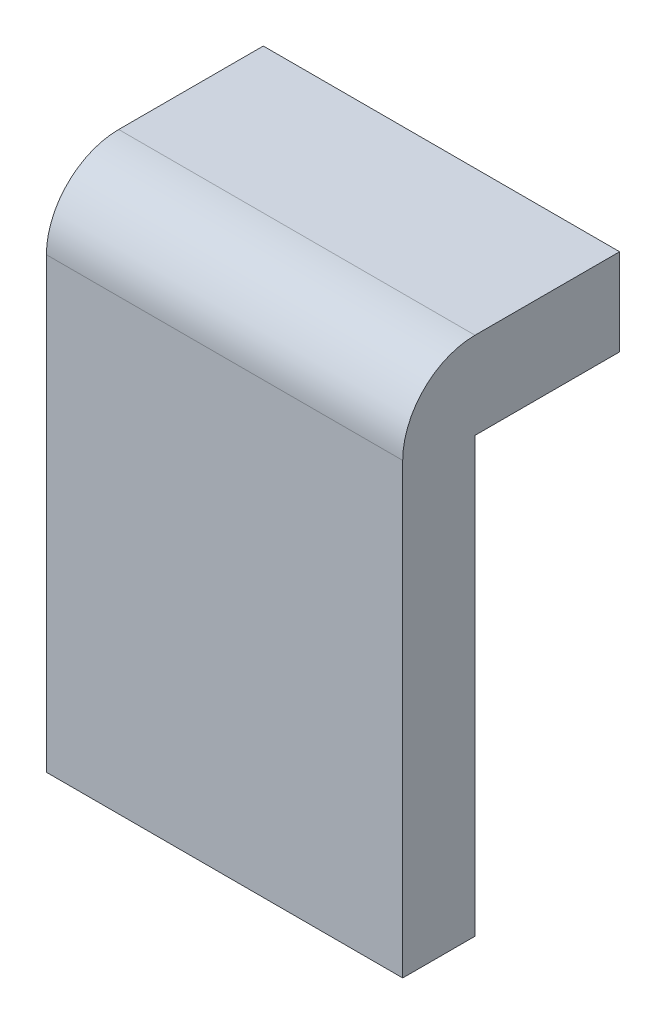
ISO-10303-21;
HEADER;
FILE_DESCRIPTION(('STEP AP214'),'2;1');
FILE_NAME('part.step','',(''),(''),'','','');
FILE_SCHEMA(('AUTOMOTIVE_DESIGN { 1 0 10303 214 1 1 1 1 }'));
ENDSEC;
DATA;
#1=APPLICATION_CONTEXT('core data for automotive mechanical design processes');
#2=APPLICATION_PROTOCOL_DEFINITION('international standard','automotive_design',2000,#1);
#3=PRODUCT_CONTEXT('',#1,'mechanical');
#4=PRODUCT('Part','Part','',(#3));
#5=PRODUCT_RELATED_PRODUCT_CATEGORY('part','',(#4));
#6=PRODUCT_DEFINITION_FORMATION('','',#4);
#7=PRODUCT_DEFINITION_CONTEXT('part definition',#1,'design');
#8=PRODUCT_DEFINITION('design','',#6,#7);
#9=PRODUCT_DEFINITION_SHAPE('','',#8);
#10=(LENGTH_UNIT() NAMED_UNIT(*) SI_UNIT(.MILLI.,.METRE.));
#11=(NAMED_UNIT(*) PLANE_ANGLE_UNIT() SI_UNIT($,.RADIAN.));
#12=(NAMED_UNIT(*) SI_UNIT($,.STERADIAN.) SOLID_ANGLE_UNIT());
#13=UNCERTAINTY_MEASURE_WITH_UNIT(LENGTH_MEASURE(1.E-05),#10,'distance_accuracy_value','');
#14=(GEOMETRIC_REPRESENTATION_CONTEXT(3) GLOBAL_UNCERTAINTY_ASSIGNED_CONTEXT((#13)) GLOBAL_UNIT_ASSIGNED_CONTEXT((#10,
#11,#12)) REPRESENTATION_CONTEXT('',''));
#15=CARTESIAN_POINT('',(0.,0.,0.));
#16=DIRECTION('',(0.,0.,1.));
#17=DIRECTION('',(1.,0.,0.));
#18=AXIS2_PLACEMENT_3D('',#15,#16,#17);
#19=CARTESIAN_POINT('',(-8.34906661620967,8.30000000000001,12.2546737770755));
#20=DIRECTION('',(0.,0.,1.));
#21=DIRECTION('',(0.,-1.,0.));
#22=AXIS2_PLACEMENT_3D('',#19,#20,#21);
#23=PLANE('',#22);
#24=DIRECTION('',(1.,0.,0.));
#25=VECTOR('',#24,1.);
#26=CARTESIAN_POINT('',(-15.8147962412963,6.80000000000003,12.2546737770755));
#27=LINE('',#26,#25);
#28=CARTESIAN_POINT('',(21.709066144855,6.80000000000003,12.2546737770755));
#29=VERTEX_POINT('',#28);
#30=CARTESIAN_POINT('',(22.9412169012958,6.80000000000003,12.2546737770755));
#31=VERTEX_POINT('',#30);
#32=EDGE_CURVE('E113',#29,#31,#27,.T.);
#33=ORIENTED_EDGE('',*,*,#32,.F.);
#34=DIRECTION('',(0.,1.,0.));
#35=VECTOR('',#34,1.);
#36=CARTESIAN_POINT('',(21.709066144855,5.35753839337147,12.2546737770755));
#37=LINE('',#36,#35);
#38=CARTESIAN_POINT('',(21.709066144855,8.30000000000001,12.2546737770755));
#39=VERTEX_POINT('',#38);
#40=EDGE_CURVE('E148',#39,#29,#37,.F.);
#41=ORIENTED_EDGE('',*,*,#40,.F.);
#42=DIRECTION('',(1.,0.,0.));
#43=VECTOR('',#42,1.);
#44=CARTESIAN_POINT('',(-8.34906661620967,8.30000000000001,12.2546737770755));
#45=LINE('',#44,#43);
#46=CARTESIAN_POINT('',(22.9412169012958,8.30000000000001,12.2546737770755));
#47=VERTEX_POINT('',#46);
#48=EDGE_CURVE('E133',#39,#47,#45,.T.);
#49=ORIENTED_EDGE('',*,*,#48,.T.);
#50=DIRECTION('',(0.,1.,0.));
#51=VECTOR('',#50,1.);
#52=CARTESIAN_POINT('',(22.9412169012958,5.35753839337147,12.2546737770755));
#53=LINE('',#52,#51);
#54=EDGE_CURVE('E105',#31,#47,#53,.T.);
#55=ORIENTED_EDGE('',*,*,#54,.F.);
#56=EDGE_LOOP('',(#33,#41,#49,#55));
#57=FACE_BOUND('',#56,.T.);
#58=ADVANCED_FACE('F17',(#57),#23,.F.);
#59=CARTESIAN_POINT('',(-8.34906661620967,8.30000000000001,11.7546737770755));
#60=DIRECTION('',(0.,1.,0.));
#61=DIRECTION('',(0.,0.,1.));
#62=AXIS2_PLACEMENT_3D('',#59,#60,#61);
#63=PLANE('',#62);
#64=ORIENTED_EDGE('',*,*,#48,.F.);
#65=DIRECTION('',(0.,0.,1.));
#66=VECTOR('',#65,1.);
#67=CARTESIAN_POINT('',(21.709066144855,8.30000000000001,12.5046737770755));
#68=LINE('',#67,#66);
#69=CARTESIAN_POINT('',(21.709066144855,8.30000000000001,11.7546737770755));
#70=VERTEX_POINT('',#69);
#71=EDGE_CURVE('E153',#70,#39,#68,.T.);
#72=ORIENTED_EDGE('',*,*,#71,.F.);
#73=DIRECTION('',(1.,0.,0.));
#74=VECTOR('',#73,1.);
#75=CARTESIAN_POINT('',(21.709066144855,8.30000000000001,11.7546737770755));
#76=LINE('',#75,#74);
#77=CARTESIAN_POINT('',(22.9412169012958,8.30000000000001,11.7546737770755));
#78=VERTEX_POINT('',#77);
#79=EDGE_CURVE('E124',#78,#70,#76,.F.);
#80=ORIENTED_EDGE('',*,*,#79,.F.);
#81=DIRECTION('',(0.,0.,-1.));
#82=VECTOR('',#81,1.);
#83=CARTESIAN_POINT('',(22.9412169012958,8.30000000000001,12.5046737770755));
#84=LINE('',#83,#82);
#85=EDGE_CURVE('E129',#47,#78,#84,.T.);
#86=ORIENTED_EDGE('',*,*,#85,.F.);
#87=EDGE_LOOP('',(#64,#72,#80,#86));
#88=FACE_BOUND('',#87,.T.);
#89=ADVANCED_FACE('F175',(#88),#63,.F.);
#90=CARTESIAN_POINT('',(21.709066144855,5.35753839337146,11.7546737770755));
#91=DIRECTION('',(0.,0.,-1.));
#92=DIRECTION('',(0.,1.,0.));
#93=AXIS2_PLACEMENT_3D('',#90,#91,#92);
#94=PLANE('',#93);
#95=ORIENTED_EDGE('',*,*,#79,.T.);
#96=DIRECTION('',(0.,1.,0.));
#97=VECTOR('',#96,1.);
#98=CARTESIAN_POINT('',(21.709066144855,5.35753839337147,11.7546737770755));
#99=LINE('',#98,#97);
#100=CARTESIAN_POINT('',(21.709066144855,8.6,11.7546737770755));
#101=VERTEX_POINT('',#100);
#102=EDGE_CURVE('E119',#101,#70,#99,.F.);
#103=ORIENTED_EDGE('',*,*,#102,.F.);
#104=DIRECTION('',(1.,0.,0.));
#105=VECTOR('',#104,1.);
#106=CARTESIAN_POINT('',(-8.34906661620967,8.6,11.7546737770755));
#107=LINE('',#106,#105);
#108=CARTESIAN_POINT('',(22.9412169012958,8.6,11.7546737770755));
#109=VERTEX_POINT('',#108);
#110=EDGE_CURVE('E122',#101,#109,#107,.T.);
#111=ORIENTED_EDGE('',*,*,#110,.T.);
#112=DIRECTION('',(0.,1.,0.));
#113=VECTOR('',#112,1.);
#114=CARTESIAN_POINT('',(22.9412169012958,5.35753839337147,11.7546737770755));
#115=LINE('',#114,#113);
#116=EDGE_CURVE('E97',#78,#109,#115,.T.);
#117=ORIENTED_EDGE('',*,*,#116,.F.);
#118=EDGE_LOOP('',(#95,#103,#111,#117));
#119=FACE_BOUND('',#118,.T.);
#120=ADVANCED_FACE('F172',(#119),#94,.T.);
#121=CARTESIAN_POINT('',(-8.34906661620967,8.6,11.7546737770755));
#122=DIRECTION('',(0.,-1.,0.));
#123=DIRECTION('',(0.,0.,-1.));
#124=AXIS2_PLACEMENT_3D('',#121,#122,#123);
#125=PLANE('',#124);
#126=ORIENTED_EDGE('',*,*,#110,.F.);
#127=DIRECTION('',(0.,0.,1.));
#128=VECTOR('',#127,1.);
#129=CARTESIAN_POINT('',(21.709066144855,8.6,12.5046737770755));
#130=LINE('',#129,#128);
#131=CARTESIAN_POINT('',(21.709066144855,8.6,12.2546737770755));
#132=VERTEX_POINT('',#131);
#133=EDGE_CURVE('E83',#132,#101,#130,.F.);
#134=ORIENTED_EDGE('',*,*,#133,.F.);
#135=DIRECTION('',(1.,0.,0.));
#136=VECTOR('',#135,1.);
#137=CARTESIAN_POINT('',(-8.34906661620967,8.6,12.2546737770755));
#138=LINE('',#137,#136);
#139=CARTESIAN_POINT('',(22.9412169012958,8.6,12.2546737770755));
#140=VERTEX_POINT('',#139);
#141=EDGE_CURVE('E79',#140,#132,#138,.F.);
#142=ORIENTED_EDGE('',*,*,#141,.F.);
#143=DIRECTION('',(0.,0.,-1.));
#144=VECTOR('',#143,1.);
#145=CARTESIAN_POINT('',(22.9412169012958,8.6,12.5046737770755));
#146=LINE('',#145,#144);
#147=EDGE_CURVE('E94',#109,#140,#146,.F.);
#148=ORIENTED_EDGE('',*,*,#147,.F.);
#149=EDGE_LOOP('',(#126,#134,#142,#148));
#150=FACE_BOUND('',#149,.T.);
#151=ADVANCED_FACE('F168',(#150),#125,.F.);
#152=CARTESIAN_POINT('',(-8.34906661620967,8.35,12.2546737770755));
#153=DIRECTION('',(1.,0.,0.));
#154=DIRECTION('',(0.,0.,-1.));
#155=AXIS2_PLACEMENT_3D('',#152,#153,#154);
#156=CYLINDRICAL_SURFACE('',#155,0.249999999999995);
#157=CARTESIAN_POINT('',(21.709066144855,8.35,12.2546737770755));
#158=DIRECTION('',(1.,0.,0.));
#159=DIRECTION('',(0.,0.,-1.));
#160=AXIS2_PLACEMENT_3D('',#157,#158,#159);
#161=CIRCLE('',#160,0.249999999999995);
#162=CARTESIAN_POINT('',(21.709066144855,8.35,12.5046737770755));
#163=VERTEX_POINT('',#162);
#164=EDGE_CURVE('E20',#163,#132,#161,.F.);
#165=ORIENTED_EDGE('',*,*,#164,.F.);
#166=DIRECTION('',(1.,0.,0.));
#167=VECTOR('',#166,1.);
#168=CARTESIAN_POINT('',(21.709066144855,8.35,12.5046737770755));
#169=LINE('',#168,#167);
#170=CARTESIAN_POINT('',(22.9412169012958,8.35,12.5046737770755));
#171=VERTEX_POINT('',#170);
#172=EDGE_CURVE('E77',#171,#163,#169,.F.);
#173=ORIENTED_EDGE('',*,*,#172,.F.);
#174=CARTESIAN_POINT('',(22.9412169012957,8.35,12.2546737770755));
#175=DIRECTION('',(1.,0.,0.));
#176=DIRECTION('',(0.,0.,-1.));
#177=AXIS2_PLACEMENT_3D('',#174,#175,#176);
#178=CIRCLE('',#177,0.249999999999995);
#179=EDGE_CURVE('E106',#140,#171,#178,.T.);
#180=ORIENTED_EDGE('',*,*,#179,.F.);
#181=ORIENTED_EDGE('',*,*,#141,.T.);
#182=EDGE_LOOP('',(#165,#173,#180,#181));
#183=FACE_BOUND('',#182,.T.);
#184=ADVANCED_FACE('F74',(#183),#156,.T.);
#185=CARTESIAN_POINT('',(21.709066144855,5.35753839337147,12.5046737770755));
#186=DIRECTION('',(-1.,0.,0.));
#187=DIRECTION('',(0.,0.,1.));
#188=AXIS2_PLACEMENT_3D('',#185,#186,#187);
#189=PLANE('',#188);
#190=DIRECTION('',(0.,0.,-1.));
#191=VECTOR('',#190,1.);
#192=CARTESIAN_POINT('',(21.709066144855,6.80000000000003,12.5046737770755));
#193=LINE('',#192,#191);
#194=CARTESIAN_POINT('',(21.709066144855,6.80000000000003,12.5046737770755));
#195=VERTEX_POINT('',#194);
#196=EDGE_CURVE('E89',#195,#29,#193,.T.);
#197=ORIENTED_EDGE('',*,*,#196,.F.);
#198=DIRECTION('',(0.,-1.,0.));
#199=VECTOR('',#198,1.);
#200=CARTESIAN_POINT('',(21.709066144855,5.35753839337147,12.5046737770755));
#201=LINE('',#200,#199);
#202=EDGE_CURVE('E85',#163,#195,#201,.T.);
#203=ORIENTED_EDGE('',*,*,#202,.F.);
#204=ORIENTED_EDGE('',*,*,#164,.T.);
#205=ORIENTED_EDGE('',*,*,#133,.T.);
#206=ORIENTED_EDGE('',*,*,#102,.T.);
#207=ORIENTED_EDGE('',*,*,#71,.T.);
#208=ORIENTED_EDGE('',*,*,#40,.T.);
#209=EDGE_LOOP('',(#197,#203,#204,#205,#206,#207,#208));
#210=FACE_BOUND('',#209,.T.);
#211=ADVANCED_FACE('F86',(#210),#189,.T.);
#212=CARTESIAN_POINT('',(-15.8147962412963,6.80000000000003,12.5046737770755));
#213=DIRECTION('',(0.,-1.,0.));
#214=DIRECTION('',(0.,0.,-1.));
#215=AXIS2_PLACEMENT_3D('',#212,#213,#214);
#216=PLANE('',#215);
#217=DIRECTION('',(1.,0.,0.));
#218=VECTOR('',#217,1.);
#219=CARTESIAN_POINT('',(21.709066144855,6.80000000000003,12.5046737770755));
#220=LINE('',#219,#218);
#221=CARTESIAN_POINT('',(22.9412169012958,6.80000000000003,12.5046737770755));
#222=VERTEX_POINT('',#221);
#223=EDGE_CURVE('E26',#195,#222,#220,.T.);
#224=ORIENTED_EDGE('',*,*,#223,.F.);
#225=ORIENTED_EDGE('',*,*,#196,.T.);
#226=ORIENTED_EDGE('',*,*,#32,.T.);
#227=DIRECTION('',(0.,0.,-1.));
#228=VECTOR('',#227,1.);
#229=CARTESIAN_POINT('',(22.9412169012958,6.80000000000003,12.5046737770755));
#230=LINE('',#229,#228);
#231=EDGE_CURVE('E35',#222,#31,#230,.T.);
#232=ORIENTED_EDGE('',*,*,#231,.F.);
#233=EDGE_LOOP('',(#224,#225,#226,#232));
#234=FACE_BOUND('',#233,.T.);
#235=ADVANCED_FACE('F179',(#234),#216,.T.);
#236=CARTESIAN_POINT('',(22.9412169012958,5.35753839337147,12.5046737770755));
#237=DIRECTION('',(1.,0.,0.));
#238=DIRECTION('',(0.,0.,-1.));
#239=AXIS2_PLACEMENT_3D('',#236,#237,#238);
#240=PLANE('',#239);
#241=ORIENTED_EDGE('',*,*,#116,.T.);
#242=ORIENTED_EDGE('',*,*,#147,.T.);
#243=ORIENTED_EDGE('',*,*,#179,.T.);
#244=DIRECTION('',(0.,-1.,0.));
#245=VECTOR('',#244,1.);
#246=CARTESIAN_POINT('',(22.9412169012958,5.35753839337147,12.5046737770755));
#247=LINE('',#246,#245);
#248=EDGE_CURVE('E11',#222,#171,#247,.F.);
#249=ORIENTED_EDGE('',*,*,#248,.F.);
#250=ORIENTED_EDGE('',*,*,#231,.T.);
#251=ORIENTED_EDGE('',*,*,#54,.T.);
#252=ORIENTED_EDGE('',*,*,#85,.T.);
#253=EDGE_LOOP('',(#241,#242,#243,#249,#250,#251,#252));
#254=FACE_BOUND('',#253,.T.);
#255=ADVANCED_FACE('F164',(#254),#240,.T.);
#256=CARTESIAN_POINT('',(21.709066144855,5.35753839337147,12.5046737770755));
#257=DIRECTION('',(0.,0.,1.));
#258=DIRECTION('',(0.,-1.,0.));
#259=AXIS2_PLACEMENT_3D('',#256,#257,#258);
#260=PLANE('',#259);
#261=ORIENTED_EDGE('',*,*,#223,.T.);
#262=ORIENTED_EDGE('',*,*,#248,.T.);
#263=ORIENTED_EDGE('',*,*,#172,.T.);
#264=ORIENTED_EDGE('',*,*,#202,.T.);
#265=EDGE_LOOP('',(#261,#262,#263,#264));
#266=FACE_BOUND('',#265,.T.);
#267=ADVANCED_FACE('F93',(#266),#260,.T.);
#268=CLOSED_SHELL('',(#58,#89,#120,#151,#184,#211,#235,#255,#267));
#269=MANIFOLD_SOLID_BREP('B1',#268);
#270=ADVANCED_BREP_SHAPE_REPRESENTATION('',(#18,#269),#14);
#271=SHAPE_DEFINITION_REPRESENTATION(#9,#270);
ENDSEC;
END-ISO-10303-21;
